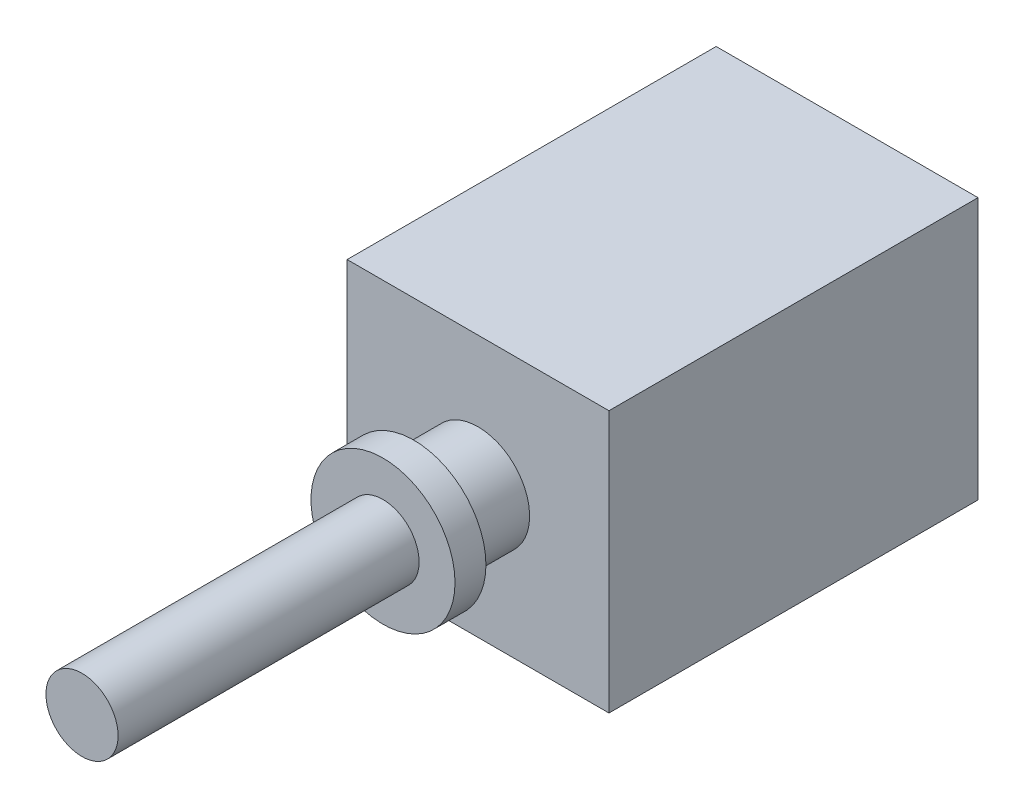
ISO-10303-21;
HEADER;
FILE_DESCRIPTION(('STEP AP214'),'2;1');
FILE_NAME('part.step','',(''),(''),'','','');
FILE_SCHEMA(('AUTOMOTIVE_DESIGN { 1 0 10303 214 1 1 1 1 }'));
ENDSEC;
DATA;
#1=APPLICATION_CONTEXT('core data for automotive mechanical design processes');
#2=APPLICATION_PROTOCOL_DEFINITION('international standard','automotive_design',2000,#1);
#3=PRODUCT_CONTEXT('',#1,'mechanical');
#4=PRODUCT('Part','Part','',(#3));
#5=PRODUCT_RELATED_PRODUCT_CATEGORY('part','',(#4));
#6=PRODUCT_DEFINITION_FORMATION('','',#4);
#7=PRODUCT_DEFINITION_CONTEXT('part definition',#1,'design');
#8=PRODUCT_DEFINITION('design','',#6,#7);
#9=PRODUCT_DEFINITION_SHAPE('','',#8);
#10=(LENGTH_UNIT() NAMED_UNIT(*) SI_UNIT(.MILLI.,.METRE.));
#11=(NAMED_UNIT(*) PLANE_ANGLE_UNIT() SI_UNIT($,.RADIAN.));
#12=(NAMED_UNIT(*) SI_UNIT($,.STERADIAN.) SOLID_ANGLE_UNIT());
#13=UNCERTAINTY_MEASURE_WITH_UNIT(LENGTH_MEASURE(1.E-05),#10,'distance_accuracy_value','');
#14=(GEOMETRIC_REPRESENTATION_CONTEXT(3) GLOBAL_UNCERTAINTY_ASSIGNED_CONTEXT((#13)) GLOBAL_UNIT_ASSIGNED_CONTEXT((#10,
#11,#12)) REPRESENTATION_CONTEXT('',''));
#15=CARTESIAN_POINT('',(0.,0.,0.));
#16=DIRECTION('',(0.,0.,1.));
#17=DIRECTION('',(1.,0.,0.));
#18=AXIS2_PLACEMENT_3D('',#15,#16,#17);
#19=CARTESIAN_POINT('',(0.,0.,225.1));
#20=DIRECTION('',(0.,0.,1.));
#21=DIRECTION('',(1.,0.,0.));
#22=AXIS2_PLACEMENT_3D('',#19,#20,#21);
#23=PLANE('',#22);
#24=CARTESIAN_POINT('',(0.,0.,225.1));
#25=DIRECTION('',(0.,0.,1.));
#26=DIRECTION('',(1.,0.,0.));
#27=AXIS2_PLACEMENT_3D('',#24,#25,#26);
#28=CIRCLE('',#27,34.925);
#29=CARTESIAN_POINT('',(34.925,0.,225.1));
#30=VERTEX_POINT('',#29);
#31=EDGE_CURVE('E152',#30,#30,#28,.T.);
#32=ORIENTED_EDGE('',*,*,#31,.T.);
#33=EDGE_LOOP('',(#32));
#34=FACE_BOUND('',#33,.T.);
#35=CARTESIAN_POINT('',(0.,0.,225.1));
#36=DIRECTION('',(0.,0.,1.));
#37=DIRECTION('',(1.,0.,0.));
#38=AXIS2_PLACEMENT_3D('',#35,#36,#37);
#39=CIRCLE('',#38,17.5);
#40=CARTESIAN_POINT('',(17.5,0.,225.1));
#41=VERTEX_POINT('',#40);
#42=EDGE_CURVE('E160',#41,#41,#39,.T.);
#43=ORIENTED_EDGE('',*,*,#42,.F.);
#44=EDGE_LOOP('',(#43));
#45=FACE_BOUND('',#44,.T.);
#46=ADVANCED_FACE('F34',(#34,#45),#23,.T.);
#47=CARTESIAN_POINT('',(63.5,63.5,179.));
#48=DIRECTION('',(0.,0.,-1.));
#49=DIRECTION('',(-1.,0.,0.));
#50=AXIS2_PLACEMENT_3D('',#47,#48,#49);
#51=PLANE('',#50);
#52=DIRECTION('',(0.,1.,0.));
#53=VECTOR('',#52,1.);
#54=CARTESIAN_POINT('',(63.5,-63.5,179.));
#55=LINE('',#54,#53);
#56=CARTESIAN_POINT('',(63.5,-63.5,179.));
#57=VERTEX_POINT('',#56);
#58=CARTESIAN_POINT('',(63.5,63.5,179.));
#59=VERTEX_POINT('',#58);
#60=EDGE_CURVE('E88',#57,#59,#55,.T.);
#61=ORIENTED_EDGE('',*,*,#60,.T.);
#62=DIRECTION('',(-1.,0.,0.));
#63=VECTOR('',#62,1.);
#64=CARTESIAN_POINT('',(-63.5,63.5,179.));
#65=LINE('',#64,#63);
#66=CARTESIAN_POINT('',(-63.5,63.5,179.));
#67=VERTEX_POINT('',#66);
#68=EDGE_CURVE('E82',#59,#67,#65,.T.);
#69=ORIENTED_EDGE('',*,*,#68,.T.);
#70=DIRECTION('',(0.,-1.,0.));
#71=VECTOR('',#70,1.);
#72=CARTESIAN_POINT('',(-63.5,-63.5,179.));
#73=LINE('',#72,#71);
#74=CARTESIAN_POINT('',(-63.5,-63.5,179.));
#75=VERTEX_POINT('',#74);
#76=EDGE_CURVE('E86',#67,#75,#73,.T.);
#77=ORIENTED_EDGE('',*,*,#76,.T.);
#78=DIRECTION('',(1.,0.,0.));
#79=VECTOR('',#78,1.);
#80=CARTESIAN_POINT('',(-63.5,-63.5,179.));
#81=LINE('',#80,#79);
#82=EDGE_CURVE('E51',#75,#57,#81,.T.);
#83=ORIENTED_EDGE('',*,*,#82,.T.);
#84=EDGE_LOOP('',(#61,#69,#77,#83));
#85=FACE_BOUND('',#84,.T.);
#86=CARTESIAN_POINT('',(0.,0.,179.));
#87=DIRECTION('',(0.,0.,-1.));
#88=DIRECTION('',(-1.,0.,0.));
#89=AXIS2_PLACEMENT_3D('',#86,#87,#88);
#90=CIRCLE('',#89,25.);
#91=CARTESIAN_POINT('',(-25.,0.,179.));
#92=VERTEX_POINT('',#91);
#93=EDGE_CURVE('E11',#92,#92,#90,.F.);
#94=ORIENTED_EDGE('',*,*,#93,.F.);
#95=EDGE_LOOP('',(#94));
#96=FACE_BOUND('',#95,.T.);
#97=ADVANCED_FACE('F83',(#85,#96),#51,.F.);
#98=CARTESIAN_POINT('',(63.5,-63.5,179.));
#99=DIRECTION('',(-1.,0.,0.));
#100=DIRECTION('',(0.,0.,1.));
#101=AXIS2_PLACEMENT_3D('',#98,#99,#100);
#102=PLANE('',#101);
#103=DIRECTION('',(0.,1.,0.));
#104=VECTOR('',#103,1.);
#105=CARTESIAN_POINT('',(63.5,-63.5,0.));
#106=LINE('',#105,#104);
#107=CARTESIAN_POINT('',(63.5,-63.5,0.));
#108=VERTEX_POINT('',#107);
#109=CARTESIAN_POINT('',(63.5,63.5,0.));
#110=VERTEX_POINT('',#109);
#111=EDGE_CURVE('E102',#108,#110,#106,.T.);
#112=ORIENTED_EDGE('',*,*,#111,.T.);
#113=DIRECTION('',(0.,0.,-1.));
#114=VECTOR('',#113,1.);
#115=CARTESIAN_POINT('',(63.5,63.5,179.));
#116=LINE('',#115,#114);
#117=EDGE_CURVE('E43',#59,#110,#116,.T.);
#118=ORIENTED_EDGE('',*,*,#117,.F.);
#119=ORIENTED_EDGE('',*,*,#60,.F.);
#120=DIRECTION('',(0.,0.,-1.));
#121=VECTOR('',#120,1.);
#122=CARTESIAN_POINT('',(63.5,-63.5,179.));
#123=LINE('',#122,#121);
#124=EDGE_CURVE('E98',#57,#108,#123,.T.);
#125=ORIENTED_EDGE('',*,*,#124,.T.);
#126=EDGE_LOOP('',(#112,#118,#119,#125));
#127=FACE_BOUND('',#126,.T.);
#128=ADVANCED_FACE('F36',(#127),#102,.F.);
#129=CARTESIAN_POINT('',(-63.5,63.5,179.));
#130=DIRECTION('',(0.,-1.,0.));
#131=DIRECTION('',(0.,0.,-1.));
#132=AXIS2_PLACEMENT_3D('',#129,#130,#131);
#133=PLANE('',#132);
#134=DIRECTION('',(-1.,0.,0.));
#135=VECTOR('',#134,1.);
#136=CARTESIAN_POINT('',(-63.5,63.5,0.));
#137=LINE('',#136,#135);
#138=CARTESIAN_POINT('',(-63.5,63.5,0.));
#139=VERTEX_POINT('',#138);
#140=EDGE_CURVE('E93',#110,#139,#137,.T.);
#141=ORIENTED_EDGE('',*,*,#140,.T.);
#142=DIRECTION('',(0.,0.,-1.));
#143=VECTOR('',#142,1.);
#144=CARTESIAN_POINT('',(-63.5,63.5,179.));
#145=LINE('',#144,#143);
#146=EDGE_CURVE('E91',#67,#139,#145,.T.);
#147=ORIENTED_EDGE('',*,*,#146,.F.);
#148=ORIENTED_EDGE('',*,*,#68,.F.);
#149=ORIENTED_EDGE('',*,*,#117,.T.);
#150=EDGE_LOOP('',(#141,#147,#148,#149));
#151=FACE_BOUND('',#150,.T.);
#152=ADVANCED_FACE('F92',(#151),#133,.F.);
#153=CARTESIAN_POINT('',(-63.5,-63.5,179.));
#154=DIRECTION('',(1.,0.,0.));
#155=DIRECTION('',(0.,0.,-1.));
#156=AXIS2_PLACEMENT_3D('',#153,#154,#155);
#157=PLANE('',#156);
#158=DIRECTION('',(0.,-1.,0.));
#159=VECTOR('',#158,1.);
#160=CARTESIAN_POINT('',(-63.5,-63.5,0.));
#161=LINE('',#160,#159);
#162=CARTESIAN_POINT('',(-63.5,-63.5,0.));
#163=VERTEX_POINT('',#162);
#164=EDGE_CURVE('E68',#139,#163,#161,.T.);
#165=ORIENTED_EDGE('',*,*,#164,.T.);
#166=DIRECTION('',(0.,0.,-1.));
#167=VECTOR('',#166,1.);
#168=CARTESIAN_POINT('',(-63.5,-63.5,179.));
#169=LINE('',#168,#167);
#170=EDGE_CURVE('E94',#75,#163,#169,.T.);
#171=ORIENTED_EDGE('',*,*,#170,.F.);
#172=ORIENTED_EDGE('',*,*,#76,.F.);
#173=ORIENTED_EDGE('',*,*,#146,.T.);
#174=EDGE_LOOP('',(#165,#171,#172,#173));
#175=FACE_BOUND('',#174,.T.);
#176=ADVANCED_FACE('F96',(#175),#157,.F.);
#177=CARTESIAN_POINT('',(-63.5,-63.5,179.));
#178=DIRECTION('',(0.,1.,0.));
#179=DIRECTION('',(0.,0.,1.));
#180=AXIS2_PLACEMENT_3D('',#177,#178,#179);
#181=PLANE('',#180);
#182=DIRECTION('',(1.,0.,0.));
#183=VECTOR('',#182,1.);
#184=CARTESIAN_POINT('',(-63.5,-63.5,0.));
#185=LINE('',#184,#183);
#186=EDGE_CURVE('E74',#163,#108,#185,.T.);
#187=ORIENTED_EDGE('',*,*,#186,.T.);
#188=ORIENTED_EDGE('',*,*,#124,.F.);
#189=ORIENTED_EDGE('',*,*,#82,.F.);
#190=ORIENTED_EDGE('',*,*,#170,.T.);
#191=EDGE_LOOP('',(#187,#188,#189,#190));
#192=FACE_BOUND('',#191,.T.);
#193=ADVANCED_FACE('F116',(#192),#181,.F.);
#194=CARTESIAN_POINT('',(63.5,63.5,0.));
#195=DIRECTION('',(0.,0.,-1.));
#196=DIRECTION('',(-1.,0.,0.));
#197=AXIS2_PLACEMENT_3D('',#194,#195,#196);
#198=PLANE('',#197);
#199=ORIENTED_EDGE('',*,*,#111,.F.);
#200=ORIENTED_EDGE('',*,*,#186,.F.);
#201=ORIENTED_EDGE('',*,*,#164,.F.);
#202=ORIENTED_EDGE('',*,*,#140,.F.);
#203=EDGE_LOOP('',(#199,#200,#201,#202));
#204=FACE_BOUND('',#203,.T.);
#205=ADVANCED_FACE('F113',(#204),#198,.T.);
#206=CARTESIAN_POINT('',(0.,0.,210.1));
#207=DIRECTION('',(0.,0.,-1.));
#208=DIRECTION('',(-1.,0.,0.));
#209=AXIS2_PLACEMENT_3D('',#206,#207,#208);
#210=CYLINDRICAL_SURFACE('',#209,25.);
#211=CARTESIAN_POINT('',(0.,0.,210.1));
#212=DIRECTION('',(0.,0.,1.));
#213=DIRECTION('',(1.,0.,0.));
#214=AXIS2_PLACEMENT_3D('',#211,#212,#213);
#215=CIRCLE('',#214,25.);
#216=CARTESIAN_POINT('',(25.,0.,210.1));
#217=VERTEX_POINT('',#216);
#218=EDGE_CURVE('E105',#217,#217,#215,.T.);
#219=ORIENTED_EDGE('',*,*,#218,.F.);
#220=EDGE_LOOP('',(#219));
#221=FACE_BOUND('',#220,.T.);
#222=ORIENTED_EDGE('',*,*,#93,.T.);
#223=EDGE_LOOP('',(#222));
#224=FACE_BOUND('',#223,.T.);
#225=ADVANCED_FACE('F115',(#221,#224),#210,.T.);
#226=CARTESIAN_POINT('',(0.,0.,210.1));
#227=DIRECTION('',(0.,0.,1.));
#228=DIRECTION('',(1.,0.,0.));
#229=AXIS2_PLACEMENT_3D('',#226,#227,#228);
#230=PLANE('',#229);
#231=CARTESIAN_POINT('',(0.,0.,210.1));
#232=DIRECTION('',(0.,0.,1.));
#233=DIRECTION('',(1.,0.,0.));
#234=AXIS2_PLACEMENT_3D('',#231,#232,#233);
#235=CIRCLE('',#234,34.925);
#236=CARTESIAN_POINT('',(34.925,0.,210.1));
#237=VERTEX_POINT('',#236);
#238=EDGE_CURVE('E155',#237,#237,#235,.T.);
#239=ORIENTED_EDGE('',*,*,#238,.F.);
#240=EDGE_LOOP('',(#239));
#241=FACE_BOUND('',#240,.T.);
#242=ORIENTED_EDGE('',*,*,#218,.T.);
#243=EDGE_LOOP('',(#242));
#244=FACE_BOUND('',#243,.T.);
#245=ADVANCED_FACE('F122',(#241,#244),#230,.F.);
#246=CARTESIAN_POINT('',(0.,0.,225.1));
#247=DIRECTION('',(0.,0.,-1.));
#248=DIRECTION('',(-1.,0.,0.));
#249=AXIS2_PLACEMENT_3D('',#246,#247,#248);
#250=CYLINDRICAL_SURFACE('',#249,34.925);
#251=ORIENTED_EDGE('',*,*,#31,.F.);
#252=EDGE_LOOP('',(#251));
#253=FACE_BOUND('',#252,.T.);
#254=ORIENTED_EDGE('',*,*,#238,.T.);
#255=EDGE_LOOP('',(#254));
#256=FACE_BOUND('',#255,.T.);
#257=ADVANCED_FACE('F141',(#253,#256),#250,.T.);
#258=CARTESIAN_POINT('',(0.,0.,371.1));
#259=DIRECTION('',(0.,0.,-1.));
#260=DIRECTION('',(-1.,0.,0.));
#261=AXIS2_PLACEMENT_3D('',#258,#259,#260);
#262=CYLINDRICAL_SURFACE('',#261,17.5);
#263=CARTESIAN_POINT('',(0.,0.,371.1));
#264=DIRECTION('',(0.,0.,1.));
#265=DIRECTION('',(1.,0.,0.));
#266=AXIS2_PLACEMENT_3D('',#263,#264,#265);
#267=CIRCLE('',#266,17.5);
#268=CARTESIAN_POINT('',(17.5,0.,371.1));
#269=VERTEX_POINT('',#268);
#270=EDGE_CURVE('E156',#269,#269,#267,.T.);
#271=ORIENTED_EDGE('',*,*,#270,.F.);
#272=EDGE_LOOP('',(#271));
#273=FACE_BOUND('',#272,.T.);
#274=ORIENTED_EDGE('',*,*,#42,.T.);
#275=EDGE_LOOP('',(#274));
#276=FACE_BOUND('',#275,.T.);
#277=ADVANCED_FACE('F137',(#273,#276),#262,.T.);
#278=CARTESIAN_POINT('',(0.,0.,371.1));
#279=DIRECTION('',(0.,0.,1.));
#280=DIRECTION('',(1.,0.,0.));
#281=AXIS2_PLACEMENT_3D('',#278,#279,#280);
#282=PLANE('',#281);
#283=ORIENTED_EDGE('',*,*,#270,.T.);
#284=EDGE_LOOP('',(#283));
#285=FACE_BOUND('',#284,.T.);
#286=ADVANCED_FACE('F148',(#285),#282,.T.);
#287=CLOSED_SHELL('',(#46,#97,#128,#152,#176,#193,#205,#225,#245,#257,#277,#286));
#288=MANIFOLD_SOLID_BREP('B2',#287);
#289=ADVANCED_BREP_SHAPE_REPRESENTATION('',(#18,#288),#14);
#290=SHAPE_DEFINITION_REPRESENTATION(#9,#289);
ENDSEC;
END-ISO-10303-21;
